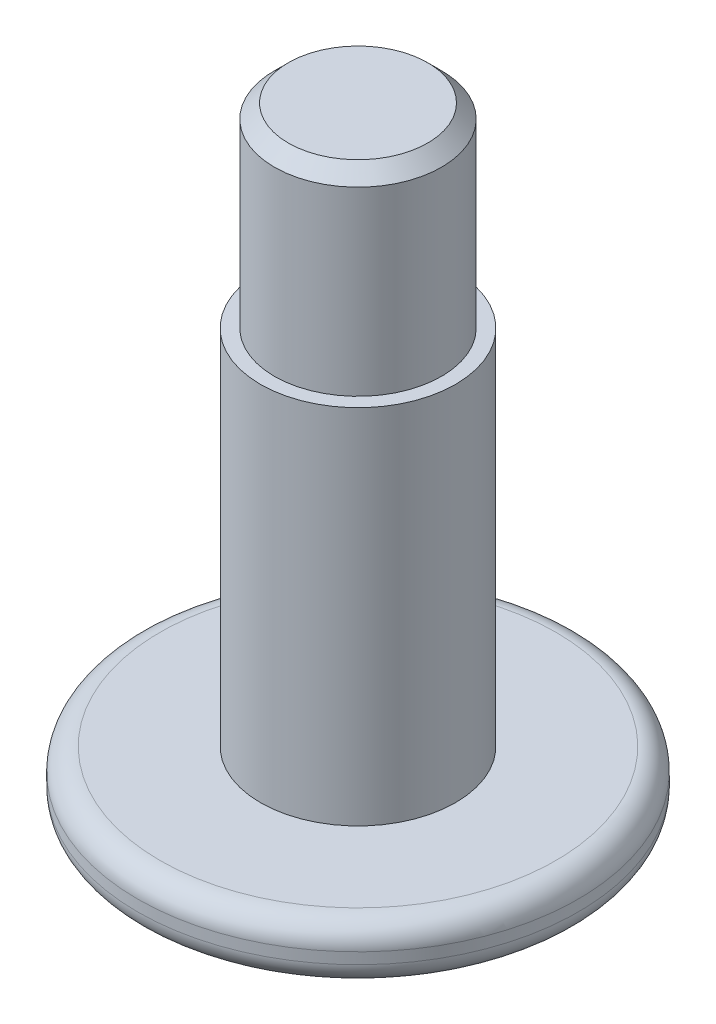
ISO-10303-21;
HEADER;
FILE_DESCRIPTION(('STEP AP214'),'2;1');
FILE_NAME('part.step','',(''),(''),'','','');
FILE_SCHEMA(('AUTOMOTIVE_DESIGN { 1 0 10303 214 1 1 1 1 }'));
ENDSEC;
DATA;
#1=APPLICATION_CONTEXT('core data for automotive mechanical design processes');
#2=APPLICATION_PROTOCOL_DEFINITION('international standard','automotive_design',2000,#1);
#3=PRODUCT_CONTEXT('',#1,'mechanical');
#4=PRODUCT('Part','Part','',(#3));
#5=PRODUCT_RELATED_PRODUCT_CATEGORY('part','',(#4));
#6=PRODUCT_DEFINITION_FORMATION('','',#4);
#7=PRODUCT_DEFINITION_CONTEXT('part definition',#1,'design');
#8=PRODUCT_DEFINITION('design','',#6,#7);
#9=PRODUCT_DEFINITION_SHAPE('','',#8);
#10=(LENGTH_UNIT() NAMED_UNIT(*) SI_UNIT(.MILLI.,.METRE.));
#11=(NAMED_UNIT(*) PLANE_ANGLE_UNIT() SI_UNIT($,.RADIAN.));
#12=(NAMED_UNIT(*) SI_UNIT($,.STERADIAN.) SOLID_ANGLE_UNIT());
#13=UNCERTAINTY_MEASURE_WITH_UNIT(LENGTH_MEASURE(1.E-05),#10,'distance_accuracy_value','');
#14=(GEOMETRIC_REPRESENTATION_CONTEXT(3) GLOBAL_UNCERTAINTY_ASSIGNED_CONTEXT((#13)) GLOBAL_UNIT_ASSIGNED_CONTEXT((#10,
#11,#12)) REPRESENTATION_CONTEXT('',''));
#15=CARTESIAN_POINT('',(0.,0.,0.));
#16=DIRECTION('',(0.,0.,1.));
#17=DIRECTION('',(1.,0.,0.));
#18=AXIS2_PLACEMENT_3D('',#15,#16,#17);
#19=CARTESIAN_POINT('',(1.26409386246564E-08,8.46863364163972,1.03171684974626E-09));
#20=DIRECTION('',(0.,1.,0.));
#21=DIRECTION('',(0.,0.,1.));
#22=AXIS2_PLACEMENT_3D('',#19,#20,#21);
#23=CYLINDRICAL_SURFACE('',#22,2.528);
#24=CARTESIAN_POINT('',(1.26409386246564E-08,1.81263364163972,1.03171684974626E-09));
#25=DIRECTION('',(0.,1.,0.));
#26=DIRECTION('',(0.,0.,1.));
#27=AXIS2_PLACEMENT_3D('',#24,#25,#26);
#28=CIRCLE('',#27,2.528);
#29=CARTESIAN_POINT('',(1.26409386246564E-08,1.81263364163972,2.52800000103172));
#30=VERTEX_POINT('',#29);
#31=EDGE_CURVE('E250',#30,#30,#28,.F.);
#32=ORIENTED_EDGE('',*,*,#31,.T.);
#33=EDGE_LOOP('',(#32));
#34=FACE_BOUND('',#33,.T.);
#35=CARTESIAN_POINT('',(1.26409386246564E-08,1.68463364163972,1.03171684974626E-09));
#36=DIRECTION('',(0.,-1.,0.));
#37=DIRECTION('',(0.,0.,-1.));
#38=AXIS2_PLACEMENT_3D('',#35,#36,#37);
#39=CIRCLE('',#38,2.528);
#40=CARTESIAN_POINT('',(1.26409386246564E-08,1.68463364163972,-2.52799999896828));
#41=VERTEX_POINT('',#40);
#42=EDGE_CURVE('E247',#41,#41,#39,.F.);
#43=ORIENTED_EDGE('',*,*,#42,.T.);
#44=EDGE_LOOP('',(#43));
#45=FACE_BOUND('',#44,.T.);
#46=ADVANCED_FACE('F34',(#34,#45),#23,.T.);
#47=CARTESIAN_POINT('',(-2.52799998735906,2.06863364163972,1.03171684974626E-09));
#48=DIRECTION('',(0.,1.,0.));
#49=DIRECTION('',(0.,0.,1.));
#50=AXIS2_PLACEMENT_3D('',#47,#48,#49);
#51=PLANE('',#50);
#52=CARTESIAN_POINT('',(1.26409386246564E-08,2.06863364163972,1.03171684974626E-09));
#53=DIRECTION('',(0.,1.,0.));
#54=DIRECTION('',(0.,0.,1.));
#55=AXIS2_PLACEMENT_3D('',#52,#53,#54);
#56=CIRCLE('',#55,2.272);
#57=CARTESIAN_POINT('',(1.26409386246564E-08,2.06863364163972,2.27200000103172));
#58=VERTEX_POINT('',#57);
#59=EDGE_CURVE('E244',#58,#58,#56,.T.);
#60=ORIENTED_EDGE('',*,*,#59,.T.);
#61=EDGE_LOOP('',(#60));
#62=FACE_BOUND('',#61,.T.);
#63=CARTESIAN_POINT('',(1.26409386246564E-08,2.06863364163972,1.03171684974626E-09));
#64=DIRECTION('',(0.,1.,0.));
#65=DIRECTION('',(0.,0.,1.));
#66=AXIS2_PLACEMENT_3D('',#63,#64,#65);
#67=CIRCLE('',#66,1.12);
#68=CARTESIAN_POINT('',(1.26409386246564E-08,2.06863364163972,1.12000000103172));
#69=VERTEX_POINT('',#68);
#70=EDGE_CURVE('E169',#69,#69,#67,.T.);
#71=ORIENTED_EDGE('',*,*,#70,.F.);
#72=EDGE_LOOP('',(#71));
#73=FACE_BOUND('',#72,.T.);
#74=ADVANCED_FACE('F270',(#62,#73),#51,.T.);
#75=CARTESIAN_POINT('',(1.26409386246564E-08,8.46863364163972,1.03171684974626E-09));
#76=DIRECTION('',(0.,1.,0.));
#77=DIRECTION('',(0.,0.,1.));
#78=AXIS2_PLACEMENT_3D('',#75,#76,#77);
#79=CYLINDRICAL_SURFACE('',#78,1.12);
#80=ORIENTED_EDGE('',*,*,#70,.T.);
#81=EDGE_LOOP('',(#80));
#82=FACE_BOUND('',#81,.T.);
#83=CARTESIAN_POINT('',(1.26409386246564E-08,6.22863364163972,1.03171684974626E-09));
#84=DIRECTION('',(0.,1.,0.));
#85=DIRECTION('',(0.,0.,1.));
#86=AXIS2_PLACEMENT_3D('',#83,#84,#85);
#87=CIRCLE('',#86,1.12);
#88=CARTESIAN_POINT('',(1.26409386246564E-08,6.22863364163972,1.12000000103172));
#89=VERTEX_POINT('',#88);
#90=EDGE_CURVE('E166',#89,#89,#87,.T.);
#91=ORIENTED_EDGE('',*,*,#90,.F.);
#92=EDGE_LOOP('',(#91));
#93=FACE_BOUND('',#92,.T.);
#94=ADVANCED_FACE('F275',(#82,#93),#79,.T.);
#95=CARTESIAN_POINT('',(-1.11999998735906,6.22863364163972,1.03171684974626E-09));
#96=DIRECTION('',(0.,1.,0.));
#97=DIRECTION('',(0.,0.,1.));
#98=AXIS2_PLACEMENT_3D('',#95,#96,#97);
#99=PLANE('',#98);
#100=ORIENTED_EDGE('',*,*,#90,.T.);
#101=EDGE_LOOP('',(#100));
#102=FACE_BOUND('',#101,.T.);
#103=CARTESIAN_POINT('',(1.26409386246564E-08,6.22863364163972,1.03171684974626E-09));
#104=DIRECTION('',(0.,1.,0.));
#105=DIRECTION('',(0.,0.,1.));
#106=AXIS2_PLACEMENT_3D('',#103,#104,#105);
#107=CIRCLE('',#106,0.96);
#108=CARTESIAN_POINT('',(1.26409386246564E-08,6.22863364163972,0.960000001031717));
#109=VERTEX_POINT('',#108);
#110=EDGE_CURVE('E162',#109,#109,#107,.T.);
#111=ORIENTED_EDGE('',*,*,#110,.F.);
#112=EDGE_LOOP('',(#111));
#113=FACE_BOUND('',#112,.T.);
#114=ADVANCED_FACE('F282',(#102,#113),#99,.T.);
#115=CARTESIAN_POINT('',(1.26409386246564E-08,8.46863364163972,1.03171684974626E-09));
#116=DIRECTION('',(0.,1.,0.));
#117=DIRECTION('',(0.,0.,1.));
#118=AXIS2_PLACEMENT_3D('',#115,#116,#117);
#119=CYLINDRICAL_SURFACE('',#118,0.96);
#120=CARTESIAN_POINT('',(1.26409386246564E-08,8.30863364163972,1.03171684974626E-09));
#121=DIRECTION('',(0.,1.,0.));
#122=DIRECTION('',(0.,0.,1.));
#123=AXIS2_PLACEMENT_3D('',#120,#121,#122);
#124=CIRCLE('',#123,0.96);
#125=CARTESIAN_POINT('',(1.26409386246564E-08,8.30863364163972,0.960000001031717));
#126=VERTEX_POINT('',#125);
#127=EDGE_CURVE('E11',#126,#126,#124,.F.);
#128=ORIENTED_EDGE('',*,*,#127,.T.);
#129=EDGE_LOOP('',(#128));
#130=FACE_BOUND('',#129,.T.);
#131=ORIENTED_EDGE('',*,*,#110,.T.);
#132=EDGE_LOOP('',(#131));
#133=FACE_BOUND('',#132,.T.);
#134=ADVANCED_FACE('F286',(#130,#133),#119,.T.);
#135=CARTESIAN_POINT('',(-0.959999987359061,8.46863364163972,1.03171684974626E-09));
#136=DIRECTION('',(0.,1.,0.));
#137=DIRECTION('',(0.,0.,1.));
#138=AXIS2_PLACEMENT_3D('',#135,#136,#137);
#139=PLANE('',#138);
#140=CARTESIAN_POINT('',(1.26409386246564E-08,8.46863364163972,1.03171684974626E-09));
#141=DIRECTION('',(0.,1.,0.));
#142=DIRECTION('',(0.,0.,1.));
#143=AXIS2_PLACEMENT_3D('',#140,#141,#142);
#144=CIRCLE('',#143,0.8);
#145=CARTESIAN_POINT('',(1.26409386246564E-08,8.46863364163972,0.800000001031717));
#146=VERTEX_POINT('',#145);
#147=EDGE_CURVE('E42',#146,#146,#144,.T.);
#148=ORIENTED_EDGE('',*,*,#147,.T.);
#149=EDGE_LOOP('',(#148));
#150=FACE_BOUND('',#149,.T.);
#151=ADVANCED_FACE('F258',(#150),#139,.T.);
#152=CARTESIAN_POINT('',(-0.639999987359061,1.42863364163972,1.03171684974626E-09));
#153=DIRECTION('',(0.,-1.,0.));
#154=DIRECTION('',(0.,0.,-1.));
#155=AXIS2_PLACEMENT_3D('',#152,#153,#154);
#156=PLANE('',#155);
#157=CARTESIAN_POINT('',(1.26409386246564E-08,1.42863364163972,1.03171684974626E-09));
#158=DIRECTION('',(0.,-1.,0.));
#159=DIRECTION('',(0.,0.,-1.));
#160=AXIS2_PLACEMENT_3D('',#157,#158,#159);
#161=CIRCLE('',#160,2.272);
#162=CARTESIAN_POINT('',(1.26409386246564E-08,1.42863364163972,-2.27199999896828));
#163=VERTEX_POINT('',#162);
#164=EDGE_CURVE('E253',#163,#163,#161,.T.);
#165=ORIENTED_EDGE('',*,*,#164,.T.);
#166=EDGE_LOOP('',(#165));
#167=FACE_BOUND('',#166,.T.);
#168=CARTESIAN_POINT('',(1.26409386246564E-08,1.42863364163972,1.03171684974626E-09));
#169=DIRECTION('',(0.,-1.,0.));
#170=DIRECTION('',(0.,0.,-1.));
#171=AXIS2_PLACEMENT_3D('',#168,#169,#170);
#172=CIRCLE('',#171,0.8);
#173=CARTESIAN_POINT('',(1.26409386246564E-08,1.42863364163972,-0.799999998968283));
#174=VERTEX_POINT('',#173);
#175=EDGE_CURVE('E172',#174,#174,#172,.F.);
#176=ORIENTED_EDGE('',*,*,#175,.T.);
#177=EDGE_LOOP('',(#176));
#178=FACE_BOUND('',#177,.T.);
#179=ADVANCED_FACE('F205',(#167,#178),#156,.T.);
#180=CARTESIAN_POINT('',(1.26409386246564E-08,1.42863364163972,1.03171684974626E-09));
#181=DIRECTION('',(0.,-1.,0.));
#182=DIRECTION('',(0.,0.,-1.));
#183=AXIS2_PLACEMENT_3D('',#180,#181,#182);
#184=CONICAL_SURFACE('',#183,0.8,0.785398163397446);
#185=CARTESIAN_POINT('',(0.739082258038116,1.48955138515853,-0.000127998968283139));
#186=CARTESIAN_POINT('',(0.726377197113699,1.50224665462824,0.0218778120660655));
#187=CARTESIAN_POINT('',(0.713460519973881,1.51419769939357,0.0442501531371935));
#188=CARTESIAN_POINT('',(0.6871218223371,1.53608024845049,0.0898701156492931));
#189=CARTESIAN_POINT('',(0.673697294444389,1.54599957098946,0.113122080027094));
#190=CARTESIAN_POINT('',(0.646625629052287,1.5629894571454,0.160011579931719));
#191=CARTESIAN_POINT('',(0.632985419449968,1.57010278706169,0.183637115988823));
#192=CARTESIAN_POINT('',(0.605411314896443,1.5810712309484,0.231396866048746));
#193=CARTESIAN_POINT('',(0.591478246569588,1.58493450970799,0.255529648296186));
#194=CARTESIAN_POINT('',(0.557441617235369,1.5898361816423,0.314482819621443));
#195=CARTESIAN_POINT('',(0.53725853710983,1.58894812758667,0.349440939852111));
#196=CARTESIAN_POINT('',(0.497315519082984,1.57980545637987,0.418624276482248));
#197=CARTESIAN_POINT('',(0.477556257756198,1.57153984545667,0.452848321020272));
#198=CARTESIAN_POINT('',(0.442862945249245,1.55161215600446,0.512938900965179));
#199=CARTESIAN_POINT('',(0.42776907567305,1.54099157227688,0.539082249953967));
#200=CARTESIAN_POINT('',(0.398172486627912,1.51706687461999,0.590345045910883));
#201=CARTESIAN_POINT('',(0.383668023690467,1.50377149208347,0.615467512655037));
#202=CARTESIAN_POINT('',(0.369430284087843,1.48955138515853,0.640128001031717));
#203=B_SPLINE_CURVE_WITH_KNOTS('',3,(#185,#186,#187,#188,#189,#190,#191,#192,#193,#194,#195,
#196,#197,#198,#199,#200,#201,#202),.UNSPECIFIED.,.F.,.F.,(4,2,2,2,2,2,2,2,4),(0.,
0.0852721131702775,0.171041427094073,0.255447728812351,0.33964134609969,0.460002958534525,
0.580544229550821,0.676412631154533,0.771973022562514),.UNSPECIFIED.);
#204=CARTESIAN_POINT('',(0.73900835720366,1.489625297077,1.03171684200942E-09));
#205=VERTEX_POINT('',#204);
#206=CARTESIAN_POINT('',(0.369504184922299,1.489625297077,0.640000001031717));
#207=VERTEX_POINT('',#206);
#208=EDGE_CURVE('E237',#205,#207,#203,.T.);
#209=ORIENTED_EDGE('',*,*,#208,.F.);
#210=CARTESIAN_POINT('',(0.369430284087843,1.48955138515853,-0.640127998968283));
#211=CARTESIAN_POINT('',(0.38213534501226,1.50224665462824,-0.618122187933935));
#212=CARTESIAN_POINT('',(0.395052022152078,1.51419769939358,-0.595749846862807));
#213=CARTESIAN_POINT('',(0.42139071978886,1.53608024845049,-0.550129884350707));
#214=CARTESIAN_POINT('',(0.434815247681571,1.54599957098946,-0.526877919972906));
#215=CARTESIAN_POINT('',(0.461886913073672,1.5629894571454,-0.479988420068281));
#216=CARTESIAN_POINT('',(0.475527122675991,1.57010278706169,-0.456362884011177));
#217=CARTESIAN_POINT('',(0.503101227229516,1.5810712309484,-0.408603133951254));
#218=CARTESIAN_POINT('',(0.517034295556371,1.58493450970799,-0.384470351703814));
#219=CARTESIAN_POINT('',(0.55107092489059,1.5898361816423,-0.325517180378557));
#220=CARTESIAN_POINT('',(0.57125400501613,1.58894812758667,-0.290559060147889));
#221=CARTESIAN_POINT('',(0.611197023042976,1.57980545637987,-0.221375723517751));
#222=CARTESIAN_POINT('',(0.630956284369762,1.57153984545667,-0.187151678979728));
#223=CARTESIAN_POINT('',(0.665649596876715,1.55161215600446,-0.127061099034821));
#224=CARTESIAN_POINT('',(0.680743466452909,1.54099157227688,-0.100917750046033));
#225=CARTESIAN_POINT('',(0.710340055498047,1.51706687461999,-0.0496549540891166));
#226=CARTESIAN_POINT('',(0.724844518435492,1.50377149208347,-0.0245324873449627));
#227=CARTESIAN_POINT('',(0.739082258038116,1.48955138515853,0.000128001031716848));
#228=B_SPLINE_CURVE_WITH_KNOTS('',3,(#210,#211,#212,#213,#214,#215,#216,#217,#218,#219,#220,
#221,#222,#223,#224,#225,#226,#227),.UNSPECIFIED.,.F.,.F.,(4,2,2,2,2,2,2,2,4),(0.,
0.0852721131702776,0.171041427094073,0.255447728812351,0.33964134609969,0.460002958534525,
0.580544229550822,0.676412631154533,0.771973022562514),.UNSPECIFIED.);
#229=CARTESIAN_POINT('',(0.369504184922299,1.489625297077,-0.639999998968283));
#230=VERTEX_POINT('',#229);
#231=EDGE_CURVE('E212',#230,#205,#228,.T.);
#232=ORIENTED_EDGE('',*,*,#231,.F.);
#233=CARTESIAN_POINT('',(-0.900382992218348,1.12396647210881,-0.639999998968283));
#234=CARTESIAN_POINT('',(-0.877708266814909,1.14244463502482,-0.639999998968283));
#235=CARTESIAN_POINT('',(-0.854921261830629,1.16078703286048,-0.639999998968283));
#236=CARTESIAN_POINT('',(-0.809068698850466,1.19713209634287,-0.639999998968283));
#237=CARTESIAN_POINT('',(-0.786003071136721,1.21513467394471,-0.639999998968283));
#238=CARTESIAN_POINT('',(-0.715823016563308,1.2689005561971,-0.639999998968283));
#239=CARTESIAN_POINT('',(-0.668213142942277,1.30401954610425,-0.639999998968283));
#240=CARTESIAN_POINT('',(-0.566732709254467,1.37463081792675,-0.639999998968283));
#241=CARTESIAN_POINT('',(-0.512683211761979,1.40987512694986,-0.639999998968283));
#242=CARTESIAN_POINT('',(-0.429203381531557,1.45836384883451,-0.639999998968283));
#243=CARTESIAN_POINT('',(-0.401038449407196,1.47376890797947,-0.639999998968283));
#244=CARTESIAN_POINT('',(-0.343721138605776,1.50259767452468,-0.639999998968283));
#245=CARTESIAN_POINT('',(-0.314569581930999,1.51602298370265,-0.639999998968283));
#246=CARTESIAN_POINT('',(-0.263394376638986,1.5368284778634,-0.639999998968283));
#247=CARTESIAN_POINT('',(-0.241635618946539,1.54485265715432,-0.639999998968283));
#248=CARTESIAN_POINT('',(-0.197553199551891,1.55916415470049,-0.639999998968283));
#249=CARTESIAN_POINT('',(-0.175229460456857,1.56545123358142,-0.639999998968283));
#250=CARTESIAN_POINT('',(-0.108484690726887,1.58090963424177,-0.639999998968283));
#251=CARTESIAN_POINT('',(-0.0632969799615574,1.58711191132203,-0.639999998968283));
#252=CARTESIAN_POINT('',(0.0251444596093249,1.58958894017307,-0.639999998968283));
#253=CARTESIAN_POINT('',(0.0683842162066676,1.58633615016777,-0.639999998968283));
#254=CARTESIAN_POINT('',(0.132531826425147,1.575412666181,-0.639999998968283));
#255=CARTESIAN_POINT('',(0.154003214326829,1.57068668965301,-0.639999998968283));
#256=CARTESIAN_POINT('',(0.196477836715068,1.55946456669112,-0.639999998968283));
#257=CARTESIAN_POINT('',(0.217481085197465,1.55296847325494,-0.639999998968283));
#258=CARTESIAN_POINT('',(0.281174207605223,1.53075713990766,-0.639999998968283));
#259=CARTESIAN_POINT('',(0.323012580718793,1.51261671771701,-0.639999998968283));
#260=CARTESIAN_POINT('',(0.404741542794014,1.47222874886072,-0.639999998968283));
#261=CARTESIAN_POINT('',(0.444624729759759,1.44996692126885,-0.639999998968283));
#262=CARTESIAN_POINT('',(0.520862788418356,1.40400250245289,-0.639999998968283));
#263=CARTESIAN_POINT('',(0.557294631657592,1.38042539321568,-0.639999998968283));
#264=CARTESIAN_POINT('',(0.628754797870877,1.33181676529841,-0.639999998968283));
#265=CARTESIAN_POINT('',(0.663792037428439,1.30679843566517,-0.639999998968283));
#266=CARTESIAN_POINT('',(0.698440528502632,1.28131154530862,-0.639999998968283));
#267=B_SPLINE_CURVE_WITH_KNOTS('',3,(#233,#234,#235,#236,#237,#238,#239,#240,#241,#242,#243,
#244,#245,#246,#247,#248,#249,#250,#251,#252,#253,#254,#255,#256,#257,#258,#259,#260,#261,#262,
#263,#264,#265,#266),.UNSPECIFIED.,.F.,.F.,(4,2,2,2,2,2,2,2,2,2,2,2,2,2,2,2,4),(0.,
0.0877525168823854,0.175527466075789,0.352973235347177,0.546302520623159,0.642557478613646,
0.738734126166533,0.808242665976892,0.877760779367301,1.01358880569765,1.14274812425762,
1.20863721529834,1.27452433382107,1.4109377694492,1.54783304698039,1.6779663976803,
1.80705549708008),.UNSPECIFIED.);
#268=CARTESIAN_POINT('',(-0.369504159640421,1.489625297077,-0.639999998968283));
#269=VERTEX_POINT('',#268);
#270=EDGE_CURVE('E183',#269,#230,#267,.T.);
#271=ORIENTED_EDGE('',*,*,#270,.F.);
#272=CARTESIAN_POINT('',(-0.739082232756239,1.48955138515853,0.000128001031716982));
#273=CARTESIAN_POINT('',(-0.726377171831822,1.50224665462824,-0.0218778100026318));
#274=CARTESIAN_POINT('',(-0.713460494692004,1.51419769939357,-0.0442501510737599));
#275=CARTESIAN_POINT('',(-0.687121797055222,1.53608024845049,-0.0898701135858595));
#276=CARTESIAN_POINT('',(-0.673697269162511,1.54599957098946,-0.113122077963661));
#277=CARTESIAN_POINT('',(-0.646625603770409,1.5629894571454,-0.160011577868285));
#278=CARTESIAN_POINT('',(-0.632985394168091,1.57010278706169,-0.18363711392539));
#279=CARTESIAN_POINT('',(-0.605411289614565,1.5810712309484,-0.231396863985312));
#280=CARTESIAN_POINT('',(-0.59147822128771,1.58493450970799,-0.255529646232752));
#281=CARTESIAN_POINT('',(-0.557441591953491,1.5898361816423,-0.314482817558009));
#282=CARTESIAN_POINT('',(-0.537258511827952,1.58894812758667,-0.349440937788678));
#283=CARTESIAN_POINT('',(-0.497315493801106,1.57980545637987,-0.418624274418815));
#284=CARTESIAN_POINT('',(-0.47755623247432,1.57153984545667,-0.452848318956838));
#285=CARTESIAN_POINT('',(-0.442862919967367,1.55161215600446,-0.512938898901745));
#286=CARTESIAN_POINT('',(-0.427769050391173,1.54099157227688,-0.539082247890533));
#287=CARTESIAN_POINT('',(-0.398172461346035,1.51706687461999,-0.59034504384745));
#288=CARTESIAN_POINT('',(-0.38366799840859,1.50377149208347,-0.615467510591603));
#289=CARTESIAN_POINT('',(-0.369430258805965,1.48955138515853,-0.640127998968283));
#290=B_SPLINE_CURVE_WITH_KNOTS('',3,(#272,#273,#274,#275,#276,#277,#278,#279,#280,#281,#282,
#283,#284,#285,#286,#287,#288,#289),.UNSPECIFIED.,.F.,.F.,(4,2,2,2,2,2,2,2,4),(0.,
0.0852721131702775,0.171041427094073,0.255447728812351,0.339641346099691,0.460002958534525,
0.580544229550821,0.676412631154533,0.771973022562514),.UNSPECIFIED.);
#291=CARTESIAN_POINT('',(-0.739008331921783,1.489625297077,1.03171700522696E-09));
#292=VERTEX_POINT('',#291);
#293=EDGE_CURVE('E175',#292,#269,#290,.T.);
#294=ORIENTED_EDGE('',*,*,#293,.F.);
#295=CARTESIAN_POINT('',(-0.369430258805966,1.48955138515853,0.640128001031717));
#296=CARTESIAN_POINT('',(-0.382135319730383,1.50224665462824,0.618122189997368));
#297=CARTESIAN_POINT('',(-0.395051996870201,1.51419769939358,0.59574984892624));
#298=CARTESIAN_POINT('',(-0.421390694506982,1.53608024845049,0.55012988641414));
#299=CARTESIAN_POINT('',(-0.434815222399693,1.54599957098946,0.526877922036339));
#300=CARTESIAN_POINT('',(-0.461886887791795,1.5629894571454,0.479988422131715));
#301=CARTESIAN_POINT('',(-0.475527097394114,1.57010278706169,0.45636288607461));
#302=CARTESIAN_POINT('',(-0.503101201947639,1.5810712309484,0.408603136014687));
#303=CARTESIAN_POINT('',(-0.517034270274494,1.58493450970799,0.384470353767247));
#304=CARTESIAN_POINT('',(-0.551070899608713,1.5898361816423,0.32551718244199));
#305=CARTESIAN_POINT('',(-0.571253979734252,1.58894812758667,0.290559062211322));
#306=CARTESIAN_POINT('',(-0.611196997761099,1.57980545637987,0.221375725581185));
#307=CARTESIAN_POINT('',(-0.630956259087885,1.57153984545667,0.187151681043161));
#308=CARTESIAN_POINT('',(-0.665649571594838,1.55161215600446,0.127061101098254));
#309=CARTESIAN_POINT('',(-0.680743441171032,1.54099157227688,0.100917752109466));
#310=CARTESIAN_POINT('',(-0.71034003021617,1.51706687461999,0.0496549561525503));
#311=CARTESIAN_POINT('',(-0.724844493153615,1.50377149208347,0.0245324894083965));
#312=CARTESIAN_POINT('',(-0.739082232756239,1.48955138515853,-0.000127998968283013));
#313=B_SPLINE_CURVE_WITH_KNOTS('',3,(#295,#296,#297,#298,#299,#300,#301,#302,#303,#304,#305,
#306,#307,#308,#309,#310,#311,#312),.UNSPECIFIED.,.F.,.F.,(4,2,2,2,2,2,2,2,4),(0.,
0.0852721131702778,0.171041427094073,0.255447728812351,0.339641346099691,0.460002958534525,
0.580544229550822,0.676412631154534,0.771973022562514),.UNSPECIFIED.);
#314=CARTESIAN_POINT('',(-0.369504159640422,1.489625297077,0.640000001031717));
#315=VERTEX_POINT('',#314);
#316=EDGE_CURVE('E122',#315,#292,#313,.T.);
#317=ORIENTED_EDGE('',*,*,#316,.F.);
#318=CARTESIAN_POINT('',(-0.900382992218352,1.1239664721088,0.640000001031717));
#319=CARTESIAN_POINT('',(-0.877708266814912,1.14244463502482,0.640000001031717));
#320=CARTESIAN_POINT('',(-0.854921261830632,1.16078703286048,0.640000001031717));
#321=CARTESIAN_POINT('',(-0.809068698850469,1.19713209634287,0.640000001031717));
#322=CARTESIAN_POINT('',(-0.786003071136724,1.21513467394471,0.640000001031717));
#323=CARTESIAN_POINT('',(-0.715823016563311,1.26890055619709,0.640000001031717));
#324=CARTESIAN_POINT('',(-0.66821314294228,1.30401954610425,0.640000001031717));
#325=CARTESIAN_POINT('',(-0.566732709254469,1.37463081792675,0.640000001031717));
#326=CARTESIAN_POINT('',(-0.512683211761981,1.40987512694986,0.640000001031717));
#327=CARTESIAN_POINT('',(-0.429203381531559,1.45836384883451,0.640000001031717));
#328=CARTESIAN_POINT('',(-0.401038449407197,1.47376890797946,0.640000001031717));
#329=CARTESIAN_POINT('',(-0.343721138605778,1.50259767452468,0.640000001031717));
#330=CARTESIAN_POINT('',(-0.314569581931,1.51602298370265,0.640000001031717));
#331=CARTESIAN_POINT('',(-0.263394376638987,1.5368284778634,0.640000001031717));
#332=CARTESIAN_POINT('',(-0.24163561894654,1.54485265715432,0.640000001031717));
#333=CARTESIAN_POINT('',(-0.197553199551892,1.55916415470049,0.640000001031717));
#334=CARTESIAN_POINT('',(-0.175229460456858,1.56545123358142,0.640000001031717));
#335=CARTESIAN_POINT('',(-0.108484690726887,1.58090963424177,0.640000001031717));
#336=CARTESIAN_POINT('',(-0.0632969799615579,1.58711191132203,0.640000001031717));
#337=CARTESIAN_POINT('',(0.0251444596093246,1.58958894017307,0.640000001031717));
#338=CARTESIAN_POINT('',(0.0683842162066673,1.58633615016777,0.640000001031717));
#339=CARTESIAN_POINT('',(0.132531826425147,1.575412666181,0.640000001031717));
#340=CARTESIAN_POINT('',(0.154003214326829,1.57068668965301,0.640000001031717));
#341=CARTESIAN_POINT('',(0.196477836715068,1.55946456669112,0.640000001031717));
#342=CARTESIAN_POINT('',(0.217481085197465,1.55296847325494,0.640000001031717));
#343=CARTESIAN_POINT('',(0.281174207605223,1.53075713990766,0.640000001031717));
#344=CARTESIAN_POINT('',(0.323012580718792,1.51261671771701,0.640000001031717));
#345=CARTESIAN_POINT('',(0.404741542794013,1.47222874886072,0.640000001031717));
#346=CARTESIAN_POINT('',(0.444624729759758,1.44996692126885,0.640000001031717));
#347=CARTESIAN_POINT('',(0.520862788418355,1.4040025024529,0.640000001031717));
#348=CARTESIAN_POINT('',(0.557294631657591,1.38042539321568,0.640000001031717));
#349=CARTESIAN_POINT('',(0.628754797870876,1.33181676529841,0.640000001031717));
#350=CARTESIAN_POINT('',(0.663792037428438,1.30679843566517,0.640000001031717));
#351=CARTESIAN_POINT('',(0.698440528502631,1.28131154530862,0.640000001031717));
#352=B_SPLINE_CURVE_WITH_KNOTS('',3,(#318,#319,#320,#321,#322,#323,#324,#325,#326,#327,#328,
#329,#330,#331,#332,#333,#334,#335,#336,#337,#338,#339,#340,#341,#342,#343,#344,#345,#346,#347,
#348,#349,#350,#351),.UNSPECIFIED.,.F.,.F.,(4,2,2,2,2,2,2,2,2,2,2,2,2,2,2,2,4),(0.,
0.087752516882386,0.17552746607579,0.352973235347179,0.546302520623161,0.642557478613649,
0.738734126166537,0.808242665976896,0.877760779367305,1.01358880569765,1.14274812425762,
1.20863721529834,1.27452433382108,1.4109377694492,1.54783304698039,1.67796639768031,
1.80705549708008),.UNSPECIFIED.);
#353=EDGE_CURVE('E219',#207,#315,#352,.F.);
#354=ORIENTED_EDGE('',*,*,#353,.F.);
#355=EDGE_LOOP('',(#209,#232,#271,#294,#317,#354));
#356=FACE_BOUND('',#355,.T.);
#357=ORIENTED_EDGE('',*,*,#175,.F.);
#358=EDGE_LOOP('',(#357));
#359=FACE_BOUND('',#358,.T.);
#360=ADVANCED_FACE('F190',(#356,#359),#184,.F.);
#361=CARTESIAN_POINT('',(1.26409386246564E-08,2.32463364163972,1.03171684974626E-09));
#362=DIRECTION('',(0.,-1.,0.));
#363=DIRECTION('',(0.,0.,-1.));
#364=AXIS2_PLACEMENT_3D('',#361,#362,#363);
#365=PLANE('',#364);
#366=DIRECTION('',(1.,0.,0.));
#367=VECTOR('',#366,1.);
#368=CARTESIAN_POINT('',(-0.369504159640421,2.32463364163972,-0.639999998968283));
#369=LINE('',#368,#367);
#370=CARTESIAN_POINT('',(1.26409387448416E-08,2.32463364163972,-0.639999998968283));
#371=VERTEX_POINT('',#370);
#372=CARTESIAN_POINT('',(0.369504184922299,2.32463364163972,-0.639999998968283));
#373=VERTEX_POINT('',#372);
#374=EDGE_CURVE('E131',#371,#373,#369,.T.);
#375=ORIENTED_EDGE('',*,*,#374,.T.);
#376=DIRECTION('',(0.5,0.,0.866025403784439));
#377=VECTOR('',#376,1.);
#378=CARTESIAN_POINT('',(0.369504184922299,2.32463364163972,-0.639999998968283));
#379=LINE('',#378,#377);
#380=CARTESIAN_POINT('',(0.55425627106298,2.32463364163972,-0.319999998968283));
#381=VERTEX_POINT('',#380);
#382=EDGE_CURVE('E136',#373,#381,#379,.T.);
#383=ORIENTED_EDGE('',*,*,#382,.T.);
#384=CARTESIAN_POINT('',(1.26409386246564E-08,2.32463364163972,1.03171684974626E-09));
#385=DIRECTION('',(0.,1.,0.));
#386=DIRECTION('',(0.,0.,1.));
#387=AXIS2_PLACEMENT_3D('',#384,#385,#386);
#388=CIRCLE('',#387,0.64);
#389=EDGE_CURVE('E325',#381,#371,#388,.T.);
#390=ORIENTED_EDGE('',*,*,#389,.T.);
#391=EDGE_LOOP('',(#375,#383,#390));
#392=FACE_BOUND('',#391,.T.);
#393=ADVANCED_FACE('F299',(#392),#365,.T.);
#394=CARTESIAN_POINT('',(0.73900835720366,2.32463364163972,1.03171684200942E-09));
#395=VERTEX_POINT('',#394);
#396=EDGE_CURVE('E135',#381,#395,#379,.T.);
#397=ORIENTED_EDGE('',*,*,#396,.T.);
#398=DIRECTION('',(-0.5,0.,0.866025403784439));
#399=VECTOR('',#398,1.);
#400=CARTESIAN_POINT('',(0.73900835720366,2.32463364163972,1.03171684200942E-09));
#401=LINE('',#400,#399);
#402=CARTESIAN_POINT('',(0.55425627106298,2.32463364163972,0.320000001031717));
#403=VERTEX_POINT('',#402);
#404=EDGE_CURVE('E140',#395,#403,#401,.T.);
#405=ORIENTED_EDGE('',*,*,#404,.T.);
#406=EDGE_CURVE('E163',#403,#381,#388,.T.);
#407=ORIENTED_EDGE('',*,*,#406,.T.);
#408=EDGE_LOOP('',(#397,#405,#407));
#409=FACE_BOUND('',#408,.T.);
#410=ADVANCED_FACE('F312',(#409),#365,.T.);
#411=CARTESIAN_POINT('',(0.369504184922299,2.32463364163972,0.640000001031717));
#412=VERTEX_POINT('',#411);
#413=EDGE_CURVE('E139',#403,#412,#401,.T.);
#414=ORIENTED_EDGE('',*,*,#413,.T.);
#415=DIRECTION('',(-1.,0.,0.));
#416=VECTOR('',#415,1.);
#417=CARTESIAN_POINT('',(0.369504184922299,2.32463364163972,0.640000001031717));
#418=LINE('',#417,#416);
#419=CARTESIAN_POINT('',(1.26409388650268E-08,2.32463364163972,0.640000001031717));
#420=VERTEX_POINT('',#419);
#421=EDGE_CURVE('E125',#412,#420,#418,.T.);
#422=ORIENTED_EDGE('',*,*,#421,.T.);
#423=EDGE_CURVE('E160',#420,#403,#388,.T.);
#424=ORIENTED_EDGE('',*,*,#423,.T.);
#425=EDGE_LOOP('',(#414,#422,#424));
#426=FACE_BOUND('',#425,.T.);
#427=ADVANCED_FACE('F307',(#426),#365,.T.);
#428=CARTESIAN_POINT('',(-0.369504159640422,2.32463364163972,0.640000001031717));
#429=VERTEX_POINT('',#428);
#430=EDGE_CURVE('E143',#420,#429,#418,.T.);
#431=ORIENTED_EDGE('',*,*,#430,.T.);
#432=DIRECTION('',(-0.5,0.,-0.866025403784439));
#433=VECTOR('',#432,1.);
#434=CARTESIAN_POINT('',(-0.369504159640422,2.32463364163972,0.640000001031717));
#435=LINE('',#434,#433);
#436=CARTESIAN_POINT('',(-0.554256245781102,2.32463364163972,0.320000001031717));
#437=VERTEX_POINT('',#436);
#438=EDGE_CURVE('E115',#429,#437,#435,.T.);
#439=ORIENTED_EDGE('',*,*,#438,.T.);
#440=EDGE_CURVE('E148',#437,#420,#388,.T.);
#441=ORIENTED_EDGE('',*,*,#440,.T.);
#442=EDGE_LOOP('',(#431,#439,#441));
#443=FACE_BOUND('',#442,.T.);
#444=ADVANCED_FACE('F323',(#443),#365,.T.);
#445=CARTESIAN_POINT('',(-0.739008331921783,2.32463364163972,1.03171700522696E-09));
#446=VERTEX_POINT('',#445);
#447=EDGE_CURVE('E105',#437,#446,#435,.T.);
#448=ORIENTED_EDGE('',*,*,#447,.T.);
#449=DIRECTION('',(0.5,0.,-0.866025403784439));
#450=VECTOR('',#449,1.);
#451=CARTESIAN_POINT('',(-0.739008331921783,2.32463364163972,1.03171700522696E-09));
#452=LINE('',#451,#450);
#453=CARTESIAN_POINT('',(-0.554256245781102,2.32463364163972,-0.319999998968283));
#454=VERTEX_POINT('',#453);
#455=EDGE_CURVE('E109',#446,#454,#452,.T.);
#456=ORIENTED_EDGE('',*,*,#455,.T.);
#457=EDGE_CURVE('E111',#454,#437,#388,.T.);
#458=ORIENTED_EDGE('',*,*,#457,.T.);
#459=EDGE_LOOP('',(#448,#456,#458));
#460=FACE_BOUND('',#459,.T.);
#461=ADVANCED_FACE('F107',(#460),#365,.T.);
#462=CARTESIAN_POINT('',(-0.369504159640422,2.32463364163972,0.640000001031717));
#463=DIRECTION('',(-0.866025403784439,0.,0.5));
#464=DIRECTION('',(0.5,0.,0.866025403784439));
#465=AXIS2_PLACEMENT_3D('',#462,#463,#464);
#466=PLANE('',#465);
#467=ORIENTED_EDGE('',*,*,#316,.T.);
#468=DIRECTION('',(0.,-1.,0.));
#469=VECTOR('',#468,1.);
#470=CARTESIAN_POINT('',(-0.739008331921783,2.32463364163972,1.03171700522696E-09));
#471=LINE('',#470,#469);
#472=EDGE_CURVE('E119',#446,#292,#471,.T.);
#473=ORIENTED_EDGE('',*,*,#472,.F.);
#474=ORIENTED_EDGE('',*,*,#447,.F.);
#475=ORIENTED_EDGE('',*,*,#438,.F.);
#476=DIRECTION('',(0.,-1.,0.));
#477=VECTOR('',#476,1.);
#478=CARTESIAN_POINT('',(-0.369504159640422,2.32463364163972,0.640000001031717));
#479=LINE('',#478,#477);
#480=EDGE_CURVE('E146',#429,#315,#479,.T.);
#481=ORIENTED_EDGE('',*,*,#480,.T.);
#482=EDGE_LOOP('',(#467,#473,#474,#475,#481));
#483=FACE_BOUND('',#482,.T.);
#484=ADVANCED_FACE('F120',(#483),#466,.F.);
#485=CARTESIAN_POINT('',(0.369504184922299,2.32463364163972,0.640000001031717));
#486=DIRECTION('',(0.,0.,1.));
#487=DIRECTION('',(1.,0.,0.));
#488=AXIS2_PLACEMENT_3D('',#485,#486,#487);
#489=PLANE('',#488);
#490=ORIENTED_EDGE('',*,*,#353,.T.);
#491=ORIENTED_EDGE('',*,*,#480,.F.);
#492=ORIENTED_EDGE('',*,*,#430,.F.);
#493=ORIENTED_EDGE('',*,*,#421,.F.);
#494=DIRECTION('',(0.,-1.,0.));
#495=VECTOR('',#494,1.);
#496=CARTESIAN_POINT('',(0.369504184922299,2.32463364163972,0.640000001031717));
#497=LINE('',#496,#495);
#498=EDGE_CURVE('E149',#412,#207,#497,.T.);
#499=ORIENTED_EDGE('',*,*,#498,.T.);
#500=EDGE_LOOP('',(#490,#491,#492,#493,#499));
#501=FACE_BOUND('',#500,.T.);
#502=ADVANCED_FACE('F204',(#501),#489,.F.);
#503=CARTESIAN_POINT('',(0.73900835720366,2.32463364163972,1.03171684200942E-09));
#504=DIRECTION('',(0.866025403784439,0.,0.5));
#505=DIRECTION('',(0.5,0.,-0.866025403784439));
#506=AXIS2_PLACEMENT_3D('',#503,#504,#505);
#507=PLANE('',#506);
#508=ORIENTED_EDGE('',*,*,#208,.T.);
#509=ORIENTED_EDGE('',*,*,#498,.F.);
#510=ORIENTED_EDGE('',*,*,#413,.F.);
#511=ORIENTED_EDGE('',*,*,#404,.F.);
#512=DIRECTION('',(0.,-1.,0.));
#513=VECTOR('',#512,1.);
#514=CARTESIAN_POINT('',(0.73900835720366,2.32463364163972,1.03171684200942E-09));
#515=LINE('',#514,#513);
#516=EDGE_CURVE('E152',#395,#205,#515,.T.);
#517=ORIENTED_EDGE('',*,*,#516,.T.);
#518=EDGE_LOOP('',(#508,#509,#510,#511,#517));
#519=FACE_BOUND('',#518,.T.);
#520=ADVANCED_FACE('F230',(#519),#507,.F.);
#521=CARTESIAN_POINT('',(0.369504184922299,2.32463364163972,-0.639999998968283));
#522=DIRECTION('',(0.866025403784439,0.,-0.5));
#523=DIRECTION('',(-0.5,0.,-0.866025403784439));
#524=AXIS2_PLACEMENT_3D('',#521,#522,#523);
#525=PLANE('',#524);
#526=ORIENTED_EDGE('',*,*,#231,.T.);
#527=ORIENTED_EDGE('',*,*,#516,.F.);
#528=ORIENTED_EDGE('',*,*,#396,.F.);
#529=ORIENTED_EDGE('',*,*,#382,.F.);
#530=DIRECTION('',(0.,-1.,0.));
#531=VECTOR('',#530,1.);
#532=CARTESIAN_POINT('',(0.369504184922299,2.32463364163972,-0.639999998968283));
#533=LINE('',#532,#531);
#534=EDGE_CURVE('E155',#373,#230,#533,.T.);
#535=ORIENTED_EDGE('',*,*,#534,.T.);
#536=EDGE_LOOP('',(#526,#527,#528,#529,#535));
#537=FACE_BOUND('',#536,.T.);
#538=ADVANCED_FACE('F226',(#537),#525,.F.);
#539=CARTESIAN_POINT('',(-0.369504159640421,2.32463364163972,-0.639999998968283));
#540=DIRECTION('',(0.,0.,-1.));
#541=DIRECTION('',(-1.,0.,0.));
#542=AXIS2_PLACEMENT_3D('',#539,#540,#541);
#543=PLANE('',#542);
#544=ORIENTED_EDGE('',*,*,#270,.T.);
#545=ORIENTED_EDGE('',*,*,#534,.F.);
#546=ORIENTED_EDGE('',*,*,#374,.F.);
#547=CARTESIAN_POINT('',(-0.369504159640421,2.32463364163972,-0.639999998968283));
#548=VERTEX_POINT('',#547);
#549=EDGE_CURVE('E49',#548,#371,#369,.T.);
#550=ORIENTED_EDGE('',*,*,#549,.F.);
#551=DIRECTION('',(0.,-1.,0.));
#552=VECTOR('',#551,1.);
#553=CARTESIAN_POINT('',(-0.369504159640421,2.32463364163972,-0.639999998968283));
#554=LINE('',#553,#552);
#555=EDGE_CURVE('E124',#548,#269,#554,.T.);
#556=ORIENTED_EDGE('',*,*,#555,.T.);
#557=EDGE_LOOP('',(#544,#545,#546,#550,#556));
#558=FACE_BOUND('',#557,.T.);
#559=ADVANCED_FACE('F198',(#558),#543,.F.);
#560=CARTESIAN_POINT('',(-0.739008331921783,2.32463364163972,1.03171700522696E-09));
#561=DIRECTION('',(-0.866025403784439,0.,-0.5));
#562=DIRECTION('',(-0.5,0.,0.866025403784439));
#563=AXIS2_PLACEMENT_3D('',#560,#561,#562);
#564=PLANE('',#563);
#565=ORIENTED_EDGE('',*,*,#293,.T.);
#566=ORIENTED_EDGE('',*,*,#555,.F.);
#567=EDGE_CURVE('E130',#454,#548,#452,.T.);
#568=ORIENTED_EDGE('',*,*,#567,.F.);
#569=ORIENTED_EDGE('',*,*,#455,.F.);
#570=ORIENTED_EDGE('',*,*,#472,.T.);
#571=EDGE_LOOP('',(#565,#566,#568,#569,#570));
#572=FACE_BOUND('',#571,.T.);
#573=ADVANCED_FACE('F128',(#572),#564,.F.);
#574=ORIENTED_EDGE('',*,*,#567,.T.);
#575=ORIENTED_EDGE('',*,*,#549,.T.);
#576=EDGE_CURVE('E324',#371,#454,#388,.T.);
#577=ORIENTED_EDGE('',*,*,#576,.T.);
#578=EDGE_LOOP('',(#574,#575,#577));
#579=FACE_BOUND('',#578,.T.);
#580=ADVANCED_FACE('F197',(#579),#365,.T.);
#581=CARTESIAN_POINT('',(1.26409386246564E-08,2.32463364163972,1.03171684974626E-09));
#582=DIRECTION('',(0.,-1.,0.));
#583=DIRECTION('',(0.,0.,-1.));
#584=AXIS2_PLACEMENT_3D('',#581,#582,#583);
#585=CONICAL_SURFACE('',#584,0.64,1.0471975511966);
#586=CARTESIAN_POINT('',(1.26409386246564E-08,2.69413781392108,1.03171684974626E-09));
#587=VERTEX_POINT('',#586);
#588=VERTEX_LOOP('',#587);
#589=FACE_BOUND('',#588,.T.);
#590=ORIENTED_EDGE('',*,*,#423,.F.);
#591=ORIENTED_EDGE('',*,*,#440,.F.);
#592=ORIENTED_EDGE('',*,*,#457,.F.);
#593=ORIENTED_EDGE('',*,*,#576,.F.);
#594=ORIENTED_EDGE('',*,*,#389,.F.);
#595=ORIENTED_EDGE('',*,*,#406,.F.);
#596=EDGE_LOOP('',(#590,#591,#592,#593,#594,#595));
#597=FACE_BOUND('',#596,.T.);
#598=ADVANCED_FACE('F292',(#589,#597),#585,.F.);
#599=CARTESIAN_POINT('',(1.26409386246564E-08,1.81263364163972,1.03171684974626E-09));
#600=DIRECTION('',(0.,1.,0.));
#601=DIRECTION('',(0.,0.,1.));
#602=AXIS2_PLACEMENT_3D('',#599,#600,#601);
#603=TOROIDAL_SURFACE('',#602,2.272,0.256);
#604=ORIENTED_EDGE('',*,*,#31,.F.);
#605=EDGE_LOOP('',(#604));
#606=FACE_BOUND('',#605,.T.);
#607=ORIENTED_EDGE('',*,*,#59,.F.);
#608=EDGE_LOOP('',(#607));
#609=FACE_BOUND('',#608,.T.);
#610=ADVANCED_FACE('F266',(#606,#609),#603,.T.);
#611=CARTESIAN_POINT('',(1.26409386246564E-08,1.68463364163972,1.03171684974626E-09));
#612=DIRECTION('',(0.,-1.,0.));
#613=DIRECTION('',(0.,0.,-1.));
#614=AXIS2_PLACEMENT_3D('',#611,#612,#613);
#615=TOROIDAL_SURFACE('',#614,2.272,0.256);
#616=ORIENTED_EDGE('',*,*,#164,.F.);
#617=EDGE_LOOP('',(#616));
#618=FACE_BOUND('',#617,.T.);
#619=ORIENTED_EDGE('',*,*,#42,.F.);
#620=EDGE_LOOP('',(#619));
#621=FACE_BOUND('',#620,.T.);
#622=ADVANCED_FACE('F261',(#618,#621),#615,.T.);
#623=CARTESIAN_POINT('',(1.26409386246564E-08,8.46863364163972,1.03171684974626E-09));
#624=DIRECTION('',(0.,-1.,0.));
#625=DIRECTION('',(0.,0.,-1.));
#626=AXIS2_PLACEMENT_3D('',#623,#624,#625);
#627=CONICAL_SURFACE('',#626,0.8,0.785398163397445);
#628=ORIENTED_EDGE('',*,*,#127,.F.);
#629=EDGE_LOOP('',(#628));
#630=FACE_BOUND('',#629,.T.);
#631=ORIENTED_EDGE('',*,*,#147,.F.);
#632=EDGE_LOOP('',(#631));
#633=FACE_BOUND('',#632,.T.);
#634=ADVANCED_FACE('F36',(#630,#633),#627,.T.);
#635=CLOSED_SHELL('',(#46,#74,#94,#114,#134,#151,#179,#360,#393,#410,#427,#444,#461,#484,#502,
#520,#538,#559,#573,#580,#598,#610,#622,#634));
#636=MANIFOLD_SOLID_BREP('B2',#635);
#637=ADVANCED_BREP_SHAPE_REPRESENTATION('',(#18,#636),#14);
#638=SHAPE_DEFINITION_REPRESENTATION(#9,#637);
ENDSEC;
END-ISO-10303-21;
